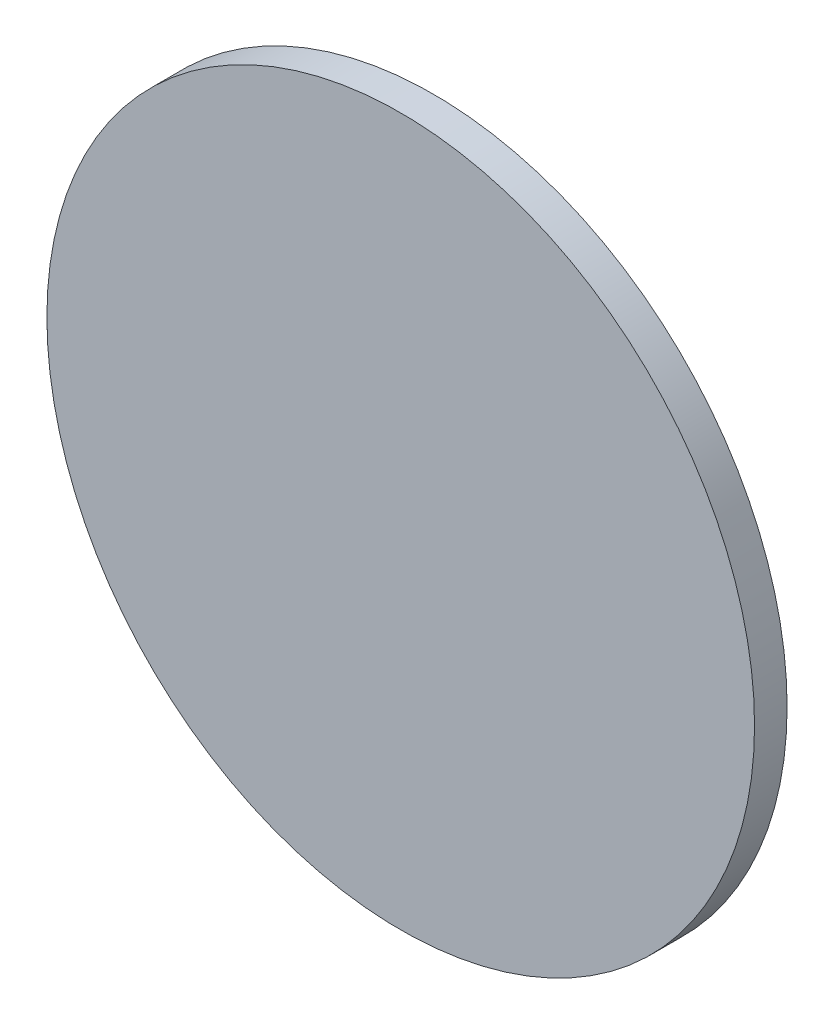
ISO-10303-21;
HEADER;
FILE_DESCRIPTION(('STEP AP214'),'2;1');
FILE_NAME('part.step','',(''),(''),'','','');
FILE_SCHEMA(('AUTOMOTIVE_DESIGN { 1 0 10303 214 1 1 1 1 }'));
ENDSEC;
DATA;
#1=APPLICATION_CONTEXT('core data for automotive mechanical design processes');
#2=APPLICATION_PROTOCOL_DEFINITION('international standard','automotive_design',2000,#1);
#3=PRODUCT_CONTEXT('',#1,'mechanical');
#4=PRODUCT('Part','Part','',(#3));
#5=PRODUCT_RELATED_PRODUCT_CATEGORY('part','',(#4));
#6=PRODUCT_DEFINITION_FORMATION('','',#4);
#7=PRODUCT_DEFINITION_CONTEXT('part definition',#1,'design');
#8=PRODUCT_DEFINITION('design','',#6,#7);
#9=PRODUCT_DEFINITION_SHAPE('','',#8);
#10=(LENGTH_UNIT() NAMED_UNIT(*) SI_UNIT(.MILLI.,.METRE.));
#11=(NAMED_UNIT(*) PLANE_ANGLE_UNIT() SI_UNIT($,.RADIAN.));
#12=(NAMED_UNIT(*) SI_UNIT($,.STERADIAN.) SOLID_ANGLE_UNIT());
#13=UNCERTAINTY_MEASURE_WITH_UNIT(LENGTH_MEASURE(1.E-05),#10,'distance_accuracy_value','');
#14=(GEOMETRIC_REPRESENTATION_CONTEXT(3) GLOBAL_UNCERTAINTY_ASSIGNED_CONTEXT((#13)) GLOBAL_UNIT_ASSIGNED_CONTEXT((#10,
#11,#12)) REPRESENTATION_CONTEXT('',''));
#15=CARTESIAN_POINT('',(0.,0.,0.));
#16=DIRECTION('',(0.,0.,1.));
#17=DIRECTION('',(1.,0.,0.));
#18=AXIS2_PLACEMENT_3D('',#15,#16,#17);
#19=CARTESIAN_POINT('',(217.229967884567,123.126483669053,2.3));
#20=DIRECTION('',(0.,0.,-1.));
#21=DIRECTION('',(-1.,0.,0.));
#22=AXIS2_PLACEMENT_3D('',#19,#20,#21);
#23=CYLINDRICAL_SURFACE('',#22,25.);
#24=CARTESIAN_POINT('',(217.229967884567,123.126483669053,2.3));
#25=DIRECTION('',(0.,0.,1.));
#26=DIRECTION('',(1.,0.,0.));
#27=AXIS2_PLACEMENT_3D('',#24,#25,#26);
#28=CIRCLE('',#27,25.);
#29=CARTESIAN_POINT('',(242.229967884567,123.126483669053,2.3));
#30=VERTEX_POINT('',#29);
#31=EDGE_CURVE('E10',#30,#30,#28,.T.);
#32=ORIENTED_EDGE('',*,*,#31,.F.);
#33=EDGE_LOOP('',(#32));
#34=FACE_BOUND('',#33,.T.);
#35=CARTESIAN_POINT('',(217.229967884567,123.126483669053,0.));
#36=DIRECTION('',(0.,0.,1.));
#37=DIRECTION('',(1.,0.,0.));
#38=AXIS2_PLACEMENT_3D('',#35,#36,#37);
#39=CIRCLE('',#38,25.);
#40=CARTESIAN_POINT('',(242.229967884567,123.126483669053,0.));
#41=VERTEX_POINT('',#40);
#42=EDGE_CURVE('E38',#41,#41,#39,.T.);
#43=ORIENTED_EDGE('',*,*,#42,.T.);
#44=EDGE_LOOP('',(#43));
#45=FACE_BOUND('',#44,.T.);
#46=ADVANCED_FACE('F35',(#34,#45),#23,.T.);
#47=CARTESIAN_POINT('',(217.229967884567,123.126483669053,2.3));
#48=DIRECTION('',(0.,0.,1.));
#49=DIRECTION('',(1.,0.,0.));
#50=AXIS2_PLACEMENT_3D('',#47,#48,#49);
#51=PLANE('',#50);
#52=ORIENTED_EDGE('',*,*,#31,.T.);
#53=EDGE_LOOP('',(#52));
#54=FACE_BOUND('',#53,.T.);
#55=ADVANCED_FACE('F50',(#54),#51,.T.);
#56=CARTESIAN_POINT('',(217.229967884567,123.126483669053,0.));
#57=DIRECTION('',(0.,0.,1.));
#58=DIRECTION('',(1.,0.,0.));
#59=AXIS2_PLACEMENT_3D('',#56,#57,#58);
#60=PLANE('',#59);
#61=ORIENTED_EDGE('',*,*,#42,.F.);
#62=EDGE_LOOP('',(#61));
#63=FACE_BOUND('',#62,.T.);
#64=ADVANCED_FACE('F48',(#63),#60,.F.);
#65=CLOSED_SHELL('',(#46,#55,#64));
#66=MANIFOLD_SOLID_BREP('B2',#65);
#67=ADVANCED_BREP_SHAPE_REPRESENTATION('',(#18,#66),#14);
#68=SHAPE_DEFINITION_REPRESENTATION(#9,#67);
ENDSEC;
END-ISO-10303-21;
